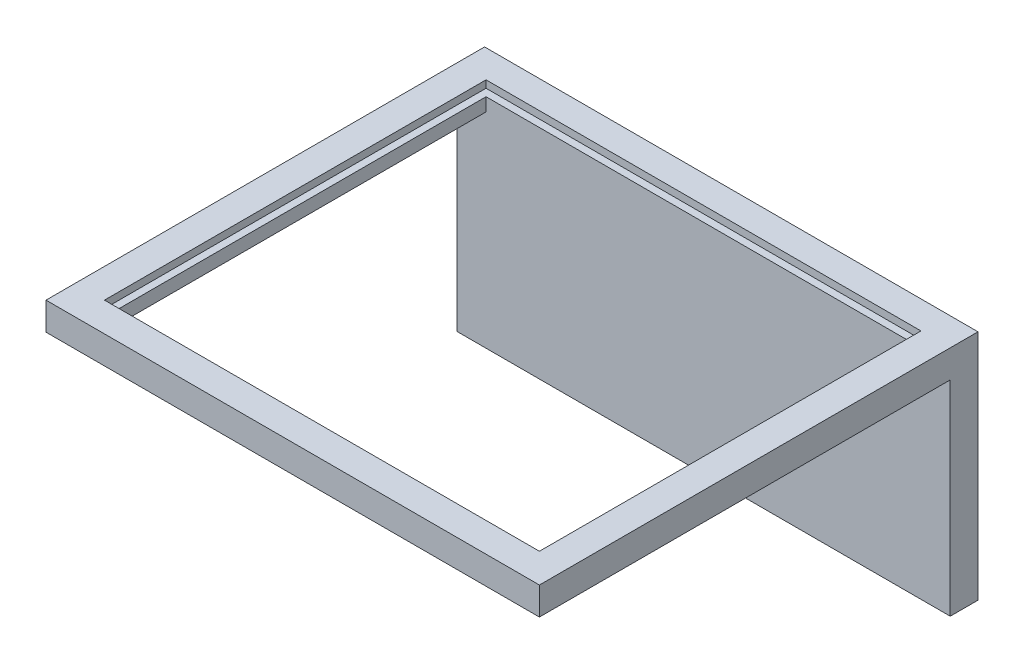
ISO-10303-21;
HEADER;
FILE_DESCRIPTION(('STEP AP214'),'2;1');
FILE_NAME('part.step','',(''),(''),'','','');
FILE_SCHEMA(('AUTOMOTIVE_DESIGN { 1 0 10303 214 1 1 1 1 }'));
ENDSEC;
DATA;
#1=APPLICATION_CONTEXT('core data for automotive mechanical design processes');
#2=APPLICATION_PROTOCOL_DEFINITION('international standard','automotive_design',2000,#1);
#3=PRODUCT_CONTEXT('',#1,'mechanical');
#4=PRODUCT('Part','Part','',(#3));
#5=PRODUCT_RELATED_PRODUCT_CATEGORY('part','',(#4));
#6=PRODUCT_DEFINITION_FORMATION('','',#4);
#7=PRODUCT_DEFINITION_CONTEXT('part definition',#1,'design');
#8=PRODUCT_DEFINITION('design','',#6,#7);
#9=PRODUCT_DEFINITION_SHAPE('','',#8);
#10=(LENGTH_UNIT() NAMED_UNIT(*) SI_UNIT(.MILLI.,.METRE.));
#11=(NAMED_UNIT(*) PLANE_ANGLE_UNIT() SI_UNIT($,.RADIAN.));
#12=(NAMED_UNIT(*) SI_UNIT($,.STERADIAN.) SOLID_ANGLE_UNIT());
#13=UNCERTAINTY_MEASURE_WITH_UNIT(LENGTH_MEASURE(1.E-05),#10,'distance_accuracy_value','');
#14=(GEOMETRIC_REPRESENTATION_CONTEXT(3) GLOBAL_UNCERTAINTY_ASSIGNED_CONTEXT((#13)) GLOBAL_UNIT_ASSIGNED_CONTEXT((#10,
#11,#12)) REPRESENTATION_CONTEXT('',''));
#15=CARTESIAN_POINT('',(0.,0.,0.));
#16=DIRECTION('',(0.,0.,1.));
#17=DIRECTION('',(1.,0.,0.));
#18=AXIS2_PLACEMENT_3D('',#15,#16,#17);
#19=CARTESIAN_POINT('',(0.,0.,1.9));
#20=DIRECTION('',(0.,0.,-1.));
#21=DIRECTION('',(-1.,0.,0.));
#22=AXIS2_PLACEMENT_3D('',#19,#20,#21);
#23=PLANE('',#22);
#24=DIRECTION('',(1.,0.,0.));
#25=VECTOR('',#24,1.);
#26=CARTESIAN_POINT('',(0.,14.9,1.9));
#27=LINE('',#26,#25);
#28=CARTESIAN_POINT('',(2.,14.9,1.9));
#29=VERTEX_POINT('',#28);
#30=CARTESIAN_POINT('',(31.75,14.9,1.9));
#31=VERTEX_POINT('',#30);
#32=EDGE_CURVE('E239',#29,#31,#27,.T.);
#33=ORIENTED_EDGE('',*,*,#32,.F.);
#34=DIRECTION('',(0.,-1.,0.));
#35=VECTOR('',#34,1.);
#36=CARTESIAN_POINT('',(2.,15.9,1.9));
#37=LINE('',#36,#35);
#38=CARTESIAN_POINT('',(2.,14.,1.9));
#39=VERTEX_POINT('',#38);
#40=EDGE_CURVE('E283',#29,#39,#37,.T.);
#41=ORIENTED_EDGE('',*,*,#40,.T.);
#42=DIRECTION('',(-1.,0.,0.));
#43=VECTOR('',#42,1.);
#44=CARTESIAN_POINT('',(0.,14.,1.9));
#45=LINE('',#44,#43);
#46=CARTESIAN_POINT('',(0.,14.,1.9));
#47=VERTEX_POINT('',#46);
#48=EDGE_CURVE('E310',#39,#47,#45,.T.);
#49=ORIENTED_EDGE('',*,*,#48,.T.);
#50=DIRECTION('',(0.,-1.,0.));
#51=VECTOR('',#50,1.);
#52=CARTESIAN_POINT('',(0.,0.,1.9));
#53=LINE('',#52,#51);
#54=CARTESIAN_POINT('',(0.,0.,1.9));
#55=VERTEX_POINT('',#54);
#56=EDGE_CURVE('E301',#47,#55,#53,.T.);
#57=ORIENTED_EDGE('',*,*,#56,.T.);
#58=DIRECTION('',(1.,0.,0.));
#59=VECTOR('',#58,1.);
#60=CARTESIAN_POINT('',(0.,0.,1.9));
#61=LINE('',#60,#59);
#62=CARTESIAN_POINT('',(33.75,0.,1.9));
#63=VERTEX_POINT('',#62);
#64=EDGE_CURVE('E304',#55,#63,#61,.T.);
#65=ORIENTED_EDGE('',*,*,#64,.T.);
#66=DIRECTION('',(0.,1.,0.));
#67=VECTOR('',#66,1.);
#68=CARTESIAN_POINT('',(33.75,0.,1.9));
#69=LINE('',#68,#67);
#70=CARTESIAN_POINT('',(33.75,14.,1.9));
#71=VERTEX_POINT('',#70);
#72=EDGE_CURVE('E307',#63,#71,#69,.T.);
#73=ORIENTED_EDGE('',*,*,#72,.T.);
#74=CARTESIAN_POINT('',(31.75,14.,1.9));
#75=VERTEX_POINT('',#74);
#76=EDGE_CURVE('E311',#71,#75,#45,.T.);
#77=ORIENTED_EDGE('',*,*,#76,.T.);
#78=DIRECTION('',(0.,-1.,0.));
#79=VECTOR('',#78,1.);
#80=CARTESIAN_POINT('',(31.75,15.9,1.9));
#81=LINE('',#80,#79);
#82=EDGE_CURVE('E291',#31,#75,#81,.T.);
#83=ORIENTED_EDGE('',*,*,#82,.F.);
#84=EDGE_LOOP('',(#33,#41,#49,#57,#65,#73,#77,#83));
#85=FACE_BOUND('',#84,.T.);
#86=ADVANCED_FACE('F43',(#85),#23,.F.);
#87=CARTESIAN_POINT('',(0.,0.,0.));
#88=DIRECTION('',(0.,0.,-1.));
#89=DIRECTION('',(-1.,0.,0.));
#90=AXIS2_PLACEMENT_3D('',#87,#88,#89);
#91=PLANE('',#90);
#92=DIRECTION('',(1.,0.,0.));
#93=VECTOR('',#92,1.);
#94=CARTESIAN_POINT('',(0.,14.6,0.));
#95=LINE('',#94,#93);
#96=CARTESIAN_POINT('',(0.699999999999999,14.6,0.));
#97=VERTEX_POINT('',#96);
#98=CARTESIAN_POINT('',(33.05,14.6,0.));
#99=VERTEX_POINT('',#98);
#100=EDGE_CURVE('E343',#97,#99,#95,.T.);
#101=ORIENTED_EDGE('',*,*,#100,.T.);
#102=DIRECTION('',(0.,1.,0.));
#103=VECTOR('',#102,1.);
#104=CARTESIAN_POINT('',(33.05,15.4,0.));
#105=LINE('',#104,#103);
#106=CARTESIAN_POINT('',(33.05,15.7,0.));
#107=VERTEX_POINT('',#106);
#108=EDGE_CURVE('E348',#99,#107,#105,.T.);
#109=ORIENTED_EDGE('',*,*,#108,.T.);
#110=DIRECTION('',(-1.,0.,0.));
#111=VECTOR('',#110,1.);
#112=CARTESIAN_POINT('',(1.,15.7,0.));
#113=LINE('',#112,#111);
#114=CARTESIAN_POINT('',(0.699999999999999,15.7,0.));
#115=VERTEX_POINT('',#114);
#116=EDGE_CURVE('E68',#107,#115,#113,.T.);
#117=ORIENTED_EDGE('',*,*,#116,.T.);
#118=DIRECTION('',(0.,-1.,0.));
#119=VECTOR('',#118,1.);
#120=CARTESIAN_POINT('',(0.699999999999999,14.9,0.));
#121=LINE('',#120,#119);
#122=EDGE_CURVE('E345',#115,#97,#121,.T.);
#123=ORIENTED_EDGE('',*,*,#122,.T.);
#124=EDGE_LOOP('',(#101,#109,#117,#123));
#125=FACE_BOUND('',#124,.T.);
#126=DIRECTION('',(0.,-1.,0.));
#127=VECTOR('',#126,1.);
#128=CARTESIAN_POINT('',(0.,0.,0.));
#129=LINE('',#128,#127);
#130=CARTESIAN_POINT('',(0.,15.9,0.));
#131=VERTEX_POINT('',#130);
#132=CARTESIAN_POINT('',(0.,0.,0.));
#133=VERTEX_POINT('',#132);
#134=EDGE_CURVE('E295',#131,#133,#129,.T.);
#135=ORIENTED_EDGE('',*,*,#134,.F.);
#136=DIRECTION('',(-1.,0.,0.));
#137=VECTOR('',#136,1.);
#138=CARTESIAN_POINT('',(0.,15.9,0.));
#139=LINE('',#138,#137);
#140=CARTESIAN_POINT('',(33.75,15.9,0.));
#141=VERTEX_POINT('',#140);
#142=EDGE_CURVE('E245',#141,#131,#139,.T.);
#143=ORIENTED_EDGE('',*,*,#142,.F.);
#144=DIRECTION('',(0.,1.,0.));
#145=VECTOR('',#144,1.);
#146=CARTESIAN_POINT('',(33.75,0.,0.));
#147=LINE('',#146,#145);
#148=CARTESIAN_POINT('',(33.75,0.,0.));
#149=VERTEX_POINT('',#148);
#150=EDGE_CURVE('E305',#149,#141,#147,.T.);
#151=ORIENTED_EDGE('',*,*,#150,.F.);
#152=DIRECTION('',(1.,0.,0.));
#153=VECTOR('',#152,1.);
#154=CARTESIAN_POINT('',(0.,0.,0.));
#155=LINE('',#154,#153);
#156=EDGE_CURVE('E317',#133,#149,#155,.T.);
#157=ORIENTED_EDGE('',*,*,#156,.F.);
#158=EDGE_LOOP('',(#135,#143,#151,#157));
#159=FACE_BOUND('',#158,.T.);
#160=ADVANCED_FACE('F383',(#125,#159),#91,.T.);
#161=CARTESIAN_POINT('',(31.75,15.9,0.));
#162=DIRECTION('',(1.,0.,0.));
#163=DIRECTION('',(0.,0.,-1.));
#164=AXIS2_PLACEMENT_3D('',#161,#162,#163);
#165=PLANE('',#164);
#166=DIRECTION('',(0.,0.,1.));
#167=VECTOR('',#166,1.);
#168=CARTESIAN_POINT('',(31.75,14.9,0.));
#169=LINE('',#168,#167);
#170=CARTESIAN_POINT('',(31.75,14.9,28.3));
#171=VERTEX_POINT('',#170);
#172=EDGE_CURVE('E237',#31,#171,#169,.T.);
#173=ORIENTED_EDGE('',*,*,#172,.F.);
#174=ORIENTED_EDGE('',*,*,#82,.T.);
#175=DIRECTION('',(0.,0.,1.));
#176=VECTOR('',#175,1.);
#177=CARTESIAN_POINT('',(31.75,14.,0.));
#178=LINE('',#177,#176);
#179=CARTESIAN_POINT('',(31.75,14.,28.));
#180=VERTEX_POINT('',#179);
#181=EDGE_CURVE('E271',#75,#180,#178,.T.);
#182=ORIENTED_EDGE('',*,*,#181,.T.);
#183=DIRECTION('',(0.,-1.,0.));
#184=VECTOR('',#183,1.);
#185=CARTESIAN_POINT('',(31.75,15.9,28.));
#186=LINE('',#185,#184);
#187=CARTESIAN_POINT('',(31.75,14.6,28.));
#188=VERTEX_POINT('',#187);
#189=EDGE_CURVE('E287',#188,#180,#186,.T.);
#190=ORIENTED_EDGE('',*,*,#189,.F.);
#191=DIRECTION('',(0.,-0.707106781186547,-0.707106781186547));
#192=VECTOR('',#191,1.);
#193=CARTESIAN_POINT('',(31.75,1.24999999999999,14.65));
#194=LINE('',#193,#192);
#195=EDGE_CURVE('E355',#188,#171,#194,.F.);
#196=ORIENTED_EDGE('',*,*,#195,.T.);
#197=EDGE_LOOP('',(#173,#174,#182,#190,#196));
#198=FACE_BOUND('',#197,.T.);
#199=ADVANCED_FACE('F386',(#198),#165,.F.);
#200=CARTESIAN_POINT('',(0.,15.9,28.));
#201=DIRECTION('',(0.,0.,-1.));
#202=DIRECTION('',(-1.,0.,0.));
#203=AXIS2_PLACEMENT_3D('',#200,#201,#202);
#204=PLANE('',#203);
#205=DIRECTION('',(0.,-1.,0.));
#206=VECTOR('',#205,1.);
#207=CARTESIAN_POINT('',(2.,15.9,28.));
#208=LINE('',#207,#206);
#209=CARTESIAN_POINT('',(2.,14.6,28.));
#210=VERTEX_POINT('',#209);
#211=CARTESIAN_POINT('',(2.,14.,28.));
#212=VERTEX_POINT('',#211);
#213=EDGE_CURVE('E282',#210,#212,#208,.T.);
#214=ORIENTED_EDGE('',*,*,#213,.F.);
#215=DIRECTION('',(1.,0.,0.));
#216=VECTOR('',#215,1.);
#217=CARTESIAN_POINT('',(0.,14.6,28.));
#218=LINE('',#217,#216);
#219=EDGE_CURVE('E329',#210,#188,#218,.T.);
#220=ORIENTED_EDGE('',*,*,#219,.T.);
#221=ORIENTED_EDGE('',*,*,#189,.T.);
#222=DIRECTION('',(1.,0.,0.));
#223=VECTOR('',#222,1.);
#224=CARTESIAN_POINT('',(0.,14.,28.));
#225=LINE('',#224,#223);
#226=EDGE_CURVE('E274',#212,#180,#225,.T.);
#227=ORIENTED_EDGE('',*,*,#226,.F.);
#228=EDGE_LOOP('',(#214,#220,#221,#227));
#229=FACE_BOUND('',#228,.T.);
#230=ADVANCED_FACE('F427',(#229),#204,.T.);
#231=CARTESIAN_POINT('',(2.,15.9,0.));
#232=DIRECTION('',(1.,0.,0.));
#233=DIRECTION('',(0.,0.,-1.));
#234=AXIS2_PLACEMENT_3D('',#231,#232,#233);
#235=PLANE('',#234);
#236=ORIENTED_EDGE('',*,*,#40,.F.);
#237=DIRECTION('',(0.,0.,1.));
#238=VECTOR('',#237,1.);
#239=CARTESIAN_POINT('',(2.,14.9,0.));
#240=LINE('',#239,#238);
#241=CARTESIAN_POINT('',(2.,14.9,28.3));
#242=VERTEX_POINT('',#241);
#243=EDGE_CURVE('E327',#29,#242,#240,.T.);
#244=ORIENTED_EDGE('',*,*,#243,.T.);
#245=DIRECTION('',(0.,0.707106781186547,0.707106781186547));
#246=VECTOR('',#245,1.);
#247=CARTESIAN_POINT('',(2.,14.6,28.));
#248=LINE('',#247,#246);
#249=EDGE_CURVE('E358',#242,#210,#248,.F.);
#250=ORIENTED_EDGE('',*,*,#249,.T.);
#251=ORIENTED_EDGE('',*,*,#213,.T.);
#252=DIRECTION('',(0.,0.,1.));
#253=VECTOR('',#252,1.);
#254=CARTESIAN_POINT('',(2.,14.,0.));
#255=LINE('',#254,#253);
#256=EDGE_CURVE('E246',#39,#212,#255,.T.);
#257=ORIENTED_EDGE('',*,*,#256,.F.);
#258=EDGE_LOOP('',(#236,#244,#250,#251,#257));
#259=FACE_BOUND('',#258,.T.);
#260=ADVANCED_FACE('F421',(#259),#235,.T.);
#261=CARTESIAN_POINT('',(0.,0.,1.9));
#262=DIRECTION('',(1.,0.,0.));
#263=DIRECTION('',(0.,1.,0.));
#264=AXIS2_PLACEMENT_3D('',#261,#262,#263);
#265=PLANE('',#264);
#266=ORIENTED_EDGE('',*,*,#134,.T.);
#267=DIRECTION('',(0.,0.,-1.));
#268=VECTOR('',#267,1.);
#269=CARTESIAN_POINT('',(0.,0.,1.9));
#270=LINE('',#269,#268);
#271=EDGE_CURVE('E322',#55,#133,#270,.T.);
#272=ORIENTED_EDGE('',*,*,#271,.F.);
#273=ORIENTED_EDGE('',*,*,#56,.F.);
#274=DIRECTION('',(0.,0.,1.));
#275=VECTOR('',#274,1.);
#276=CARTESIAN_POINT('',(0.,14.,0.));
#277=LINE('',#276,#275);
#278=CARTESIAN_POINT('',(0.,14.,30.));
#279=VERTEX_POINT('',#278);
#280=EDGE_CURVE('E266',#47,#279,#277,.T.);
#281=ORIENTED_EDGE('',*,*,#280,.T.);
#282=DIRECTION('',(0.,-1.,0.));
#283=VECTOR('',#282,1.);
#284=CARTESIAN_POINT('',(0.,15.9,30.));
#285=LINE('',#284,#283);
#286=CARTESIAN_POINT('',(0.,15.9,30.));
#287=VERTEX_POINT('',#286);
#288=EDGE_CURVE('E298',#287,#279,#285,.T.);
#289=ORIENTED_EDGE('',*,*,#288,.F.);
#290=DIRECTION('',(0.,0.,1.));
#291=VECTOR('',#290,1.);
#292=CARTESIAN_POINT('',(0.,15.9,0.));
#293=LINE('',#292,#291);
#294=EDGE_CURVE('E249',#131,#287,#293,.T.);
#295=ORIENTED_EDGE('',*,*,#294,.F.);
#296=EDGE_LOOP('',(#266,#272,#273,#281,#289,#295));
#297=FACE_BOUND('',#296,.T.);
#298=ADVANCED_FACE('F398',(#297),#265,.F.);
#299=CARTESIAN_POINT('',(0.,0.,1.9));
#300=DIRECTION('',(0.,1.,0.));
#301=DIRECTION('',(0.,0.,1.));
#302=AXIS2_PLACEMENT_3D('',#299,#300,#301);
#303=PLANE('',#302);
#304=ORIENTED_EDGE('',*,*,#156,.T.);
#305=DIRECTION('',(0.,0.,-1.));
#306=VECTOR('',#305,1.);
#307=CARTESIAN_POINT('',(33.75,0.,1.9));
#308=LINE('',#307,#306);
#309=EDGE_CURVE('E314',#63,#149,#308,.T.);
#310=ORIENTED_EDGE('',*,*,#309,.F.);
#311=ORIENTED_EDGE('',*,*,#64,.F.);
#312=ORIENTED_EDGE('',*,*,#271,.T.);
#313=EDGE_LOOP('',(#304,#310,#311,#312));
#314=FACE_BOUND('',#313,.T.);
#315=ADVANCED_FACE('F411',(#314),#303,.F.);
#316=CARTESIAN_POINT('',(33.75,0.,1.9));
#317=DIRECTION('',(-1.,0.,0.));
#318=DIRECTION('',(0.,-1.,0.));
#319=AXIS2_PLACEMENT_3D('',#316,#317,#318);
#320=PLANE('',#319);
#321=ORIENTED_EDGE('',*,*,#150,.T.);
#322=DIRECTION('',(0.,0.,1.));
#323=VECTOR('',#322,1.);
#324=CARTESIAN_POINT('',(33.75,15.9,0.));
#325=LINE('',#324,#323);
#326=CARTESIAN_POINT('',(33.75,15.9,30.));
#327=VERTEX_POINT('',#326);
#328=EDGE_CURVE('E242',#141,#327,#325,.T.);
#329=ORIENTED_EDGE('',*,*,#328,.T.);
#330=DIRECTION('',(0.,-1.,0.));
#331=VECTOR('',#330,1.);
#332=CARTESIAN_POINT('',(33.75,15.9,30.));
#333=LINE('',#332,#331);
#334=CARTESIAN_POINT('',(33.75,14.,30.));
#335=VERTEX_POINT('',#334);
#336=EDGE_CURVE('E264',#327,#335,#333,.T.);
#337=ORIENTED_EDGE('',*,*,#336,.T.);
#338=DIRECTION('',(0.,0.,1.));
#339=VECTOR('',#338,1.);
#340=CARTESIAN_POINT('',(33.75,14.,0.));
#341=LINE('',#340,#339);
#342=EDGE_CURVE('E241',#71,#335,#341,.T.);
#343=ORIENTED_EDGE('',*,*,#342,.F.);
#344=ORIENTED_EDGE('',*,*,#72,.F.);
#345=ORIENTED_EDGE('',*,*,#309,.T.);
#346=EDGE_LOOP('',(#321,#329,#337,#343,#344,#345));
#347=FACE_BOUND('',#346,.T.);
#348=ADVANCED_FACE('F407',(#347),#320,.F.);
#349=CARTESIAN_POINT('',(2.,15.9,1.9));
#350=VERTEX_POINT('',#349);
#351=CARTESIAN_POINT('',(2.,15.4,1.9));
#352=VERTEX_POINT('',#351);
#353=EDGE_CURVE('E279',#350,#352,#37,.T.);
#354=ORIENTED_EDGE('',*,*,#353,.T.);
#355=DIRECTION('',(1.,0.,0.));
#356=VECTOR('',#355,1.);
#357=CARTESIAN_POINT('',(0.,15.4,1.9));
#358=LINE('',#357,#356);
#359=CARTESIAN_POINT('',(31.75,15.4,1.9));
#360=VERTEX_POINT('',#359);
#361=EDGE_CURVE('E234',#352,#360,#358,.T.);
#362=ORIENTED_EDGE('',*,*,#361,.T.);
#363=CARTESIAN_POINT('',(31.75,15.9,1.9));
#364=VERTEX_POINT('',#363);
#365=EDGE_CURVE('E292',#364,#360,#81,.T.);
#366=ORIENTED_EDGE('',*,*,#365,.F.);
#367=DIRECTION('',(1.,0.,0.));
#368=VECTOR('',#367,1.);
#369=CARTESIAN_POINT('',(0.,15.9,1.9));
#370=LINE('',#369,#368);
#371=EDGE_CURVE('E253',#350,#364,#370,.T.);
#372=ORIENTED_EDGE('',*,*,#371,.F.);
#373=EDGE_LOOP('',(#354,#362,#366,#372));
#374=FACE_BOUND('',#373,.T.);
#375=ADVANCED_FACE('F451',(#374),#23,.F.);
#376=ORIENTED_EDGE('',*,*,#365,.T.);
#377=DIRECTION('',(0.,0.,1.));
#378=VECTOR('',#377,1.);
#379=CARTESIAN_POINT('',(31.75,15.4,0.));
#380=LINE('',#379,#378);
#381=CARTESIAN_POINT('',(31.75,15.4,28.3));
#382=VERTEX_POINT('',#381);
#383=EDGE_CURVE('E231',#360,#382,#380,.T.);
#384=ORIENTED_EDGE('',*,*,#383,.T.);
#385=DIRECTION('',(0.,0.707106781186547,-0.707106781186547));
#386=VECTOR('',#385,1.);
#387=CARTESIAN_POINT('',(31.75,29.8,13.9));
#388=LINE('',#387,#386);
#389=CARTESIAN_POINT('',(31.75,15.7,28.));
#390=VERTEX_POINT('',#389);
#391=EDGE_CURVE('E53',#382,#390,#388,.T.);
#392=ORIENTED_EDGE('',*,*,#391,.T.);
#393=CARTESIAN_POINT('',(31.75,15.9,28.));
#394=VERTEX_POINT('',#393);
#395=EDGE_CURVE('E288',#394,#390,#186,.T.);
#396=ORIENTED_EDGE('',*,*,#395,.F.);
#397=DIRECTION('',(0.,0.,1.));
#398=VECTOR('',#397,1.);
#399=CARTESIAN_POINT('',(31.75,15.9,0.));
#400=LINE('',#399,#398);
#401=EDGE_CURVE('E256',#364,#394,#400,.T.);
#402=ORIENTED_EDGE('',*,*,#401,.F.);
#403=EDGE_LOOP('',(#376,#384,#392,#396,#402));
#404=FACE_BOUND('',#403,.T.);
#405=ADVANCED_FACE('F457',(#404),#165,.F.);
#406=ORIENTED_EDGE('',*,*,#395,.T.);
#407=DIRECTION('',(-1.,0.,0.));
#408=VECTOR('',#407,1.);
#409=CARTESIAN_POINT('',(2.,15.7,28.));
#410=LINE('',#409,#408);
#411=CARTESIAN_POINT('',(2.,15.7,28.));
#412=VERTEX_POINT('',#411);
#413=EDGE_CURVE('E341',#390,#412,#410,.T.);
#414=ORIENTED_EDGE('',*,*,#413,.T.);
#415=CARTESIAN_POINT('',(2.,15.9,28.));
#416=VERTEX_POINT('',#415);
#417=EDGE_CURVE('E284',#416,#412,#208,.T.);
#418=ORIENTED_EDGE('',*,*,#417,.F.);
#419=DIRECTION('',(1.,0.,0.));
#420=VECTOR('',#419,1.);
#421=CARTESIAN_POINT('',(0.,15.9,28.));
#422=LINE('',#421,#420);
#423=EDGE_CURVE('E258',#416,#394,#422,.T.);
#424=ORIENTED_EDGE('',*,*,#423,.T.);
#425=EDGE_LOOP('',(#406,#414,#418,#424));
#426=FACE_BOUND('',#425,.T.);
#427=ADVANCED_FACE('F462',(#426),#204,.T.);
#428=CARTESIAN_POINT('',(0.,15.9,30.));
#429=DIRECTION('',(0.,0.,-1.));
#430=DIRECTION('',(-1.,0.,0.));
#431=AXIS2_PLACEMENT_3D('',#428,#429,#430);
#432=PLANE('',#431);
#433=DIRECTION('',(1.,0.,0.));
#434=VECTOR('',#433,1.);
#435=CARTESIAN_POINT('',(0.,14.,30.));
#436=LINE('',#435,#434);
#437=EDGE_CURVE('E268',#279,#335,#436,.T.);
#438=ORIENTED_EDGE('',*,*,#437,.T.);
#439=ORIENTED_EDGE('',*,*,#336,.F.);
#440=DIRECTION('',(1.,0.,0.));
#441=VECTOR('',#440,1.);
#442=CARTESIAN_POINT('',(0.,15.9,30.));
#443=LINE('',#442,#441);
#444=EDGE_CURVE('E251',#287,#327,#443,.T.);
#445=ORIENTED_EDGE('',*,*,#444,.F.);
#446=ORIENTED_EDGE('',*,*,#288,.T.);
#447=EDGE_LOOP('',(#438,#439,#445,#446));
#448=FACE_BOUND('',#447,.T.);
#449=ADVANCED_FACE('F404',(#448),#432,.F.);
#450=DIRECTION('',(0.,0.,1.));
#451=VECTOR('',#450,1.);
#452=CARTESIAN_POINT('',(2.,15.4,0.));
#453=LINE('',#452,#451);
#454=CARTESIAN_POINT('',(2.,15.4,28.3));
#455=VERTEX_POINT('',#454);
#456=EDGE_CURVE('E325',#352,#455,#453,.T.);
#457=ORIENTED_EDGE('',*,*,#456,.F.);
#458=ORIENTED_EDGE('',*,*,#353,.F.);
#459=DIRECTION('',(0.,0.,1.));
#460=VECTOR('',#459,1.);
#461=CARTESIAN_POINT('',(2.,15.9,0.));
#462=LINE('',#461,#460);
#463=EDGE_CURVE('E261',#350,#416,#462,.T.);
#464=ORIENTED_EDGE('',*,*,#463,.T.);
#465=ORIENTED_EDGE('',*,*,#417,.T.);
#466=DIRECTION('',(0.,-0.707106781186547,0.707106781186547));
#467=VECTOR('',#466,1.);
#468=CARTESIAN_POINT('',(2.,15.4,28.3));
#469=LINE('',#468,#467);
#470=EDGE_CURVE('E11',#412,#455,#469,.T.);
#471=ORIENTED_EDGE('',*,*,#470,.T.);
#472=EDGE_LOOP('',(#457,#458,#464,#465,#471));
#473=FACE_BOUND('',#472,.T.);
#474=ADVANCED_FACE('F472',(#473),#235,.T.);
#475=CARTESIAN_POINT('',(0.,15.9,0.));
#476=DIRECTION('',(0.,1.,0.));
#477=DIRECTION('',(0.,0.,1.));
#478=AXIS2_PLACEMENT_3D('',#475,#476,#477);
#479=PLANE('',#478);
#480=ORIENTED_EDGE('',*,*,#328,.F.);
#481=ORIENTED_EDGE('',*,*,#142,.T.);
#482=ORIENTED_EDGE('',*,*,#294,.T.);
#483=ORIENTED_EDGE('',*,*,#444,.T.);
#484=EDGE_LOOP('',(#480,#481,#482,#483));
#485=FACE_BOUND('',#484,.T.);
#486=ORIENTED_EDGE('',*,*,#371,.T.);
#487=ORIENTED_EDGE('',*,*,#401,.T.);
#488=ORIENTED_EDGE('',*,*,#423,.F.);
#489=ORIENTED_EDGE('',*,*,#463,.F.);
#490=EDGE_LOOP('',(#486,#487,#488,#489));
#491=FACE_BOUND('',#490,.T.);
#492=ADVANCED_FACE('F395',(#485,#491),#479,.T.);
#493=CARTESIAN_POINT('',(0.,14.,0.));
#494=DIRECTION('',(0.,1.,0.));
#495=DIRECTION('',(0.,0.,1.));
#496=AXIS2_PLACEMENT_3D('',#493,#494,#495);
#497=PLANE('',#496);
#498=ORIENTED_EDGE('',*,*,#76,.F.);
#499=ORIENTED_EDGE('',*,*,#342,.T.);
#500=ORIENTED_EDGE('',*,*,#437,.F.);
#501=ORIENTED_EDGE('',*,*,#280,.F.);
#502=ORIENTED_EDGE('',*,*,#48,.F.);
#503=ORIENTED_EDGE('',*,*,#256,.T.);
#504=ORIENTED_EDGE('',*,*,#226,.T.);
#505=ORIENTED_EDGE('',*,*,#181,.F.);
#506=EDGE_LOOP('',(#498,#499,#500,#501,#502,#503,#504,#505));
#507=FACE_BOUND('',#506,.T.);
#508=ADVANCED_FACE('F419',(#507),#497,.F.);
#509=CARTESIAN_POINT('',(0.,14.9,0.));
#510=DIRECTION('',(0.,1.,0.));
#511=DIRECTION('',(0.,0.,1.));
#512=AXIS2_PLACEMENT_3D('',#509,#510,#511);
#513=PLANE('',#512);
#514=DIRECTION('',(0.,0.,-1.));
#515=VECTOR('',#514,1.);
#516=CARTESIAN_POINT('',(32.75,14.9,0.));
#517=LINE('',#516,#515);
#518=CARTESIAN_POINT('',(32.75,14.9,29.));
#519=VERTEX_POINT('',#518);
#520=CARTESIAN_POINT('',(32.75,14.9,0.300000000000002));
#521=VERTEX_POINT('',#520);
#522=EDGE_CURVE('E219',#519,#521,#517,.T.);
#523=ORIENTED_EDGE('',*,*,#522,.T.);
#524=DIRECTION('',(-1.,0.,0.));
#525=VECTOR('',#524,1.);
#526=CARTESIAN_POINT('',(0.,14.9,0.300000000000002));
#527=LINE('',#526,#525);
#528=CARTESIAN_POINT('',(1.,14.9,0.300000000000002));
#529=VERTEX_POINT('',#528);
#530=EDGE_CURVE('E205',#521,#529,#527,.T.);
#531=ORIENTED_EDGE('',*,*,#530,.T.);
#532=DIRECTION('',(0.,0.,1.));
#533=VECTOR('',#532,1.);
#534=CARTESIAN_POINT('',(1.,14.9,0.));
#535=LINE('',#534,#533);
#536=CARTESIAN_POINT('',(1.00000000000001,14.9,29.));
#537=VERTEX_POINT('',#536);
#538=EDGE_CURVE('E197',#529,#537,#535,.T.);
#539=ORIENTED_EDGE('',*,*,#538,.T.);
#540=DIRECTION('',(1.,0.,0.));
#541=VECTOR('',#540,1.);
#542=CARTESIAN_POINT('',(1.00000000000001,14.9,29.));
#543=LINE('',#542,#541);
#544=EDGE_CURVE('E203',#537,#519,#543,.T.);
#545=ORIENTED_EDGE('',*,*,#544,.T.);
#546=EDGE_LOOP('',(#523,#531,#539,#545));
#547=FACE_BOUND('',#546,.T.);
#548=ORIENTED_EDGE('',*,*,#172,.T.);
#549=DIRECTION('',(-1.,0.,0.));
#550=VECTOR('',#549,1.);
#551=CARTESIAN_POINT('',(0.,14.9,28.3));
#552=LINE('',#551,#550);
#553=EDGE_CURVE('E333',#171,#242,#552,.T.);
#554=ORIENTED_EDGE('',*,*,#553,.T.);
#555=ORIENTED_EDGE('',*,*,#243,.F.);
#556=ORIENTED_EDGE('',*,*,#32,.T.);
#557=EDGE_LOOP('',(#548,#554,#555,#556));
#558=FACE_BOUND('',#557,.T.);
#559=ADVANCED_FACE('F200',(#547,#558),#513,.T.);
#560=CARTESIAN_POINT('',(0.,15.4,0.));
#561=DIRECTION('',(0.,1.,0.));
#562=DIRECTION('',(0.,0.,1.));
#563=AXIS2_PLACEMENT_3D('',#560,#561,#562);
#564=PLANE('',#563);
#565=DIRECTION('',(0.,0.,1.));
#566=VECTOR('',#565,1.);
#567=CARTESIAN_POINT('',(1.,15.4,0.));
#568=LINE('',#567,#566);
#569=CARTESIAN_POINT('',(1.,15.4,0.300000000000002));
#570=VERTEX_POINT('',#569);
#571=CARTESIAN_POINT('',(1.00000000000001,15.4,29.));
#572=VERTEX_POINT('',#571);
#573=EDGE_CURVE('E214',#570,#572,#568,.T.);
#574=ORIENTED_EDGE('',*,*,#573,.F.);
#575=DIRECTION('',(1.,0.,0.));
#576=VECTOR('',#575,1.);
#577=CARTESIAN_POINT('',(32.75,15.4,0.300000000000002));
#578=LINE('',#577,#576);
#579=CARTESIAN_POINT('',(32.75,15.4,0.300000000000002));
#580=VERTEX_POINT('',#579);
#581=EDGE_CURVE('E336',#570,#580,#578,.T.);
#582=ORIENTED_EDGE('',*,*,#581,.T.);
#583=DIRECTION('',(0.,0.,-1.));
#584=VECTOR('',#583,1.);
#585=CARTESIAN_POINT('',(32.75,15.4,0.));
#586=LINE('',#585,#584);
#587=CARTESIAN_POINT('',(32.75,15.4,29.));
#588=VERTEX_POINT('',#587);
#589=EDGE_CURVE('E208',#588,#580,#586,.T.);
#590=ORIENTED_EDGE('',*,*,#589,.F.);
#591=DIRECTION('',(1.,0.,0.));
#592=VECTOR('',#591,1.);
#593=CARTESIAN_POINT('',(1.00000000000001,15.4,29.));
#594=LINE('',#593,#592);
#595=EDGE_CURVE('E227',#572,#588,#594,.T.);
#596=ORIENTED_EDGE('',*,*,#595,.F.);
#597=EDGE_LOOP('',(#574,#582,#590,#596));
#598=FACE_BOUND('',#597,.T.);
#599=DIRECTION('',(1.,0.,0.));
#600=VECTOR('',#599,1.);
#601=CARTESIAN_POINT('',(31.75,15.4,28.3));
#602=LINE('',#601,#600);
#603=EDGE_CURVE('E338',#455,#382,#602,.T.);
#604=ORIENTED_EDGE('',*,*,#603,.T.);
#605=ORIENTED_EDGE('',*,*,#383,.F.);
#606=ORIENTED_EDGE('',*,*,#361,.F.);
#607=ORIENTED_EDGE('',*,*,#456,.T.);
#608=EDGE_LOOP('',(#604,#605,#606,#607));
#609=FACE_BOUND('',#608,.T.);
#610=ADVANCED_FACE('F376',(#598,#609),#564,.F.);
#611=CARTESIAN_POINT('',(1.,14.9,0.));
#612=DIRECTION('',(-1.,0.,0.));
#613=DIRECTION('',(0.,0.,1.));
#614=AXIS2_PLACEMENT_3D('',#611,#612,#613);
#615=PLANE('',#614);
#616=ORIENTED_EDGE('',*,*,#538,.F.);
#617=DIRECTION('',(0.,1.,0.));
#618=VECTOR('',#617,1.);
#619=CARTESIAN_POINT('',(1.,15.4,0.300000000000002));
#620=LINE('',#619,#618);
#621=EDGE_CURVE('E353',#529,#570,#620,.T.);
#622=ORIENTED_EDGE('',*,*,#621,.T.);
#623=ORIENTED_EDGE('',*,*,#573,.T.);
#624=DIRECTION('',(0.,1.,0.));
#625=VECTOR('',#624,1.);
#626=CARTESIAN_POINT('',(1.00000000000001,14.9,29.));
#627=LINE('',#626,#625);
#628=EDGE_CURVE('E211',#537,#572,#627,.T.);
#629=ORIENTED_EDGE('',*,*,#628,.F.);
#630=EDGE_LOOP('',(#616,#622,#623,#629));
#631=FACE_BOUND('',#630,.T.);
#632=ADVANCED_FACE('F212',(#631),#615,.F.);
#633=CARTESIAN_POINT('',(32.75,14.9,0.));
#634=DIRECTION('',(1.,0.,0.));
#635=DIRECTION('',(0.,0.,-1.));
#636=AXIS2_PLACEMENT_3D('',#633,#634,#635);
#637=PLANE('',#636);
#638=ORIENTED_EDGE('',*,*,#589,.T.);
#639=DIRECTION('',(0.,-1.,0.));
#640=VECTOR('',#639,1.);
#641=CARTESIAN_POINT('',(32.75,14.9,0.300000000000002));
#642=LINE('',#641,#640);
#643=EDGE_CURVE('E350',#580,#521,#642,.T.);
#644=ORIENTED_EDGE('',*,*,#643,.T.);
#645=ORIENTED_EDGE('',*,*,#522,.F.);
#646=DIRECTION('',(0.,1.,0.));
#647=VECTOR('',#646,1.);
#648=CARTESIAN_POINT('',(32.75,14.9,29.));
#649=LINE('',#648,#647);
#650=EDGE_CURVE('E218',#519,#588,#649,.T.);
#651=ORIENTED_EDGE('',*,*,#650,.T.);
#652=EDGE_LOOP('',(#638,#644,#645,#651));
#653=FACE_BOUND('',#652,.T.);
#654=ADVANCED_FACE('F380',(#653),#637,.F.);
#655=CARTESIAN_POINT('',(1.00000000000001,14.9,29.));
#656=DIRECTION('',(0.,0.,1.));
#657=DIRECTION('',(1.,0.,0.));
#658=AXIS2_PLACEMENT_3D('',#655,#656,#657);
#659=PLANE('',#658);
#660=ORIENTED_EDGE('',*,*,#595,.T.);
#661=ORIENTED_EDGE('',*,*,#650,.F.);
#662=ORIENTED_EDGE('',*,*,#544,.F.);
#663=ORIENTED_EDGE('',*,*,#628,.T.);
#664=EDGE_LOOP('',(#660,#661,#662,#663));
#665=FACE_BOUND('',#664,.T.);
#666=ADVANCED_FACE('F221',(#665),#659,.F.);
#667=CARTESIAN_POINT('',(0.,14.6,28.));
#668=DIRECTION('',(0.,-0.707106781186547,0.707106781186547));
#669=DIRECTION('',(1.,0.,0.));
#670=AXIS2_PLACEMENT_3D('',#667,#668,#669);
#671=PLANE('',#670);
#672=ORIENTED_EDGE('',*,*,#249,.F.);
#673=ORIENTED_EDGE('',*,*,#553,.F.);
#674=ORIENTED_EDGE('',*,*,#195,.F.);
#675=ORIENTED_EDGE('',*,*,#219,.F.);
#676=EDGE_LOOP('',(#672,#673,#674,#675));
#677=FACE_BOUND('',#676,.T.);
#678=ADVANCED_FACE('F435',(#677),#671,.F.);
#679=CARTESIAN_POINT('',(0.,15.4,28.3));
#680=DIRECTION('',(0.,-0.707106781186547,-0.707106781186547));
#681=DIRECTION('',(-1.,0.,0.));
#682=AXIS2_PLACEMENT_3D('',#679,#680,#681);
#683=PLANE('',#682);
#684=ORIENTED_EDGE('',*,*,#470,.F.);
#685=ORIENTED_EDGE('',*,*,#413,.F.);
#686=ORIENTED_EDGE('',*,*,#391,.F.);
#687=ORIENTED_EDGE('',*,*,#603,.F.);
#688=EDGE_LOOP('',(#684,#685,#686,#687));
#689=FACE_BOUND('',#688,.T.);
#690=ADVANCED_FACE('F437',(#689),#683,.T.);
#691=CARTESIAN_POINT('',(1.,14.9,0.300000000000002));
#692=DIRECTION('',(0.707106781186547,0.,-0.707106781186548));
#693=DIRECTION('',(0.,-1.,0.));
#694=AXIS2_PLACEMENT_3D('',#691,#692,#693);
#695=PLANE('',#694);
#696=DIRECTION('',(0.577350269189626,-0.577350269189626,0.577350269189626));
#697=VECTOR('',#696,1.);
#698=CARTESIAN_POINT('',(0.466666666666666,15.9333333333333,-0.233333333333333));
#699=LINE('',#698,#697);
#700=EDGE_CURVE('E363',#570,#115,#699,.F.);
#701=ORIENTED_EDGE('',*,*,#700,.F.);
#702=ORIENTED_EDGE('',*,*,#621,.F.);
#703=DIRECTION('',(-0.577350269189626,-0.577350269189626,-0.577350269189626));
#704=VECTOR('',#703,1.);
#705=CARTESIAN_POINT('',(1.,14.9,0.300000000000002));
#706=LINE('',#705,#704);
#707=EDGE_CURVE('E48',#97,#529,#706,.F.);
#708=ORIENTED_EDGE('',*,*,#707,.F.);
#709=ORIENTED_EDGE('',*,*,#122,.F.);
#710=EDGE_LOOP('',(#701,#702,#708,#709));
#711=FACE_BOUND('',#710,.T.);
#712=ADVANCED_FACE('F46',(#711),#695,.T.);
#713=CARTESIAN_POINT('',(0.,14.9,0.300000000000002));
#714=DIRECTION('',(0.,-0.707106781186548,0.707106781186548));
#715=DIRECTION('',(-1.,0.,0.));
#716=AXIS2_PLACEMENT_3D('',#713,#714,#715);
#717=PLANE('',#716);
#718=ORIENTED_EDGE('',*,*,#707,.T.);
#719=ORIENTED_EDGE('',*,*,#530,.F.);
#720=DIRECTION('',(-0.577350269189626,0.577350269189626,0.577350269189626));
#721=VECTOR('',#720,1.);
#722=CARTESIAN_POINT('',(37.9166666666667,9.73333333333333,-4.86666666666667));
#723=LINE('',#722,#721);
#724=EDGE_CURVE('E362',#99,#521,#723,.T.);
#725=ORIENTED_EDGE('',*,*,#724,.F.);
#726=ORIENTED_EDGE('',*,*,#100,.F.);
#727=EDGE_LOOP('',(#718,#719,#725,#726));
#728=FACE_BOUND('',#727,.T.);
#729=ADVANCED_FACE('F372',(#728),#717,.F.);
#730=CARTESIAN_POINT('',(0.,15.7,0.));
#731=DIRECTION('',(0.,-0.707106781186548,-0.707106781186548));
#732=DIRECTION('',(1.,0.,0.));
#733=AXIS2_PLACEMENT_3D('',#730,#731,#732);
#734=PLANE('',#733);
#735=ORIENTED_EDGE('',*,*,#700,.T.);
#736=ORIENTED_EDGE('',*,*,#116,.F.);
#737=DIRECTION('',(-0.577350269189626,-0.577350269189626,0.577350269189626));
#738=VECTOR('',#737,1.);
#739=CARTESIAN_POINT('',(27.8166666666667,10.4666666666667,5.23333333333333));
#740=LINE('',#739,#738);
#741=EDGE_CURVE('E61',#580,#107,#740,.F.);
#742=ORIENTED_EDGE('',*,*,#741,.F.);
#743=ORIENTED_EDGE('',*,*,#581,.F.);
#744=EDGE_LOOP('',(#735,#736,#742,#743));
#745=FACE_BOUND('',#744,.T.);
#746=ADVANCED_FACE('F382',(#745),#734,.T.);
#747=CARTESIAN_POINT('',(33.05,0.,0.));
#748=DIRECTION('',(-0.707106781186547,0.,-0.707106781186547));
#749=DIRECTION('',(0.,-1.,0.));
#750=AXIS2_PLACEMENT_3D('',#747,#748,#749);
#751=PLANE('',#750);
#752=ORIENTED_EDGE('',*,*,#724,.T.);
#753=ORIENTED_EDGE('',*,*,#643,.F.);
#754=ORIENTED_EDGE('',*,*,#741,.T.);
#755=ORIENTED_EDGE('',*,*,#108,.F.);
#756=EDGE_LOOP('',(#752,#753,#754,#755));
#757=FACE_BOUND('',#756,.T.);
#758=ADVANCED_FACE('F381',(#757),#751,.T.);
#759=CLOSED_SHELL('',(#86,#160,#199,#230,#260,#298,#315,#348,#375,#405,#427,#449,#474,#492,#508,
#559,#610,#632,#654,#666,#678,#690,#712,#729,#746,#758));
#760=MANIFOLD_SOLID_BREP('B2',#759);
#761=ADVANCED_BREP_SHAPE_REPRESENTATION('',(#18,#760),#14);
#762=SHAPE_DEFINITION_REPRESENTATION(#9,#761);
ENDSEC;
END-ISO-10303-21;
